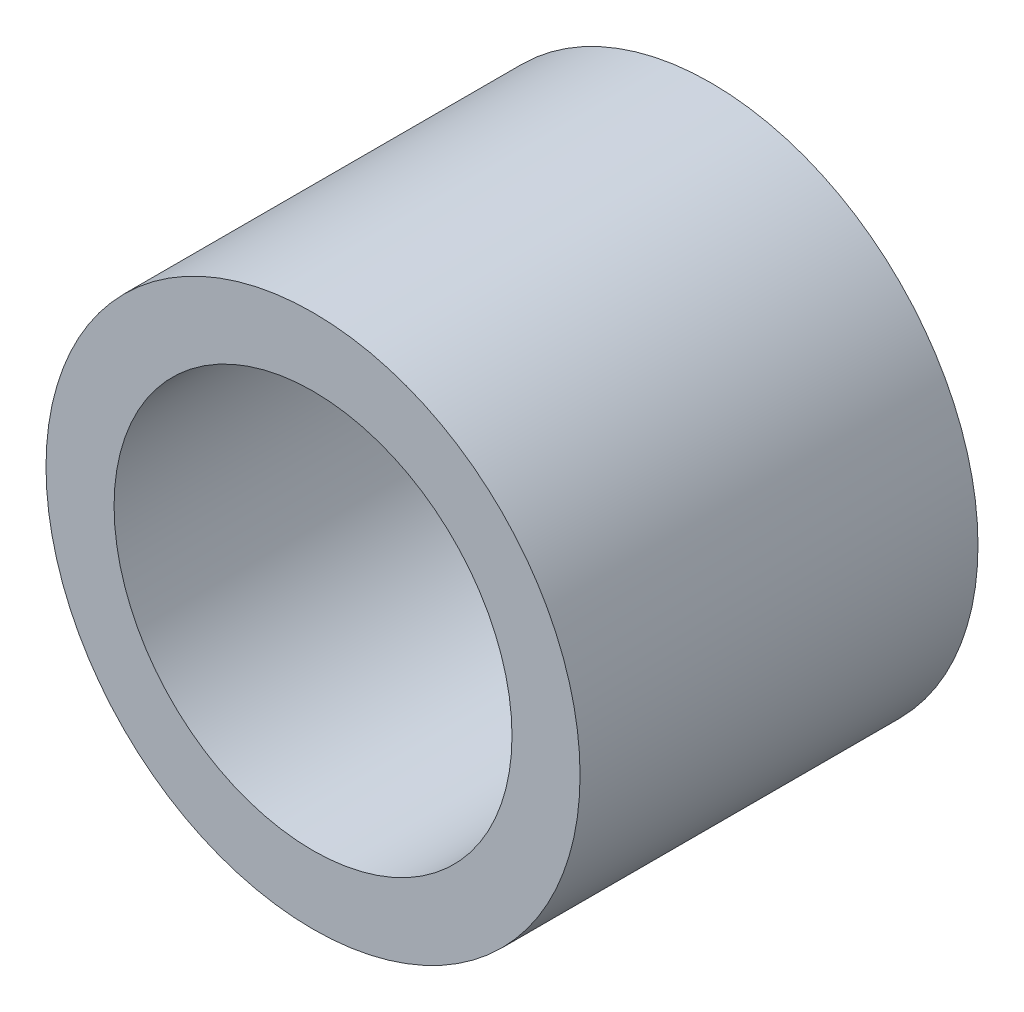
ISO-10303-21;
HEADER;
FILE_DESCRIPTION(('STEP AP214'),'2;1');
FILE_NAME('part.step','',(''),(''),'','','');
FILE_SCHEMA(('AUTOMOTIVE_DESIGN { 1 0 10303 214 1 1 1 1 }'));
ENDSEC;
DATA;
#1=APPLICATION_CONTEXT('core data for automotive mechanical design processes');
#2=APPLICATION_PROTOCOL_DEFINITION('international standard','automotive_design',2000,#1);
#3=PRODUCT_CONTEXT('',#1,'mechanical');
#4=PRODUCT('Part','Part','',(#3));
#5=PRODUCT_RELATED_PRODUCT_CATEGORY('part','',(#4));
#6=PRODUCT_DEFINITION_FORMATION('','',#4);
#7=PRODUCT_DEFINITION_CONTEXT('part definition',#1,'design');
#8=PRODUCT_DEFINITION('design','',#6,#7);
#9=PRODUCT_DEFINITION_SHAPE('','',#8);
#10=(LENGTH_UNIT() NAMED_UNIT(*) SI_UNIT(.MILLI.,.METRE.));
#11=(NAMED_UNIT(*) PLANE_ANGLE_UNIT() SI_UNIT($,.RADIAN.));
#12=(NAMED_UNIT(*) SI_UNIT($,.STERADIAN.) SOLID_ANGLE_UNIT());
#13=UNCERTAINTY_MEASURE_WITH_UNIT(LENGTH_MEASURE(1.E-05),#10,'distance_accuracy_value','');
#14=(GEOMETRIC_REPRESENTATION_CONTEXT(3) GLOBAL_UNCERTAINTY_ASSIGNED_CONTEXT((#13)) GLOBAL_UNIT_ASSIGNED_CONTEXT((#10,
#11,#12)) REPRESENTATION_CONTEXT('',''));
#15=CARTESIAN_POINT('',(0.,0.,0.));
#16=DIRECTION('',(0.,0.,1.));
#17=DIRECTION('',(1.,0.,0.));
#18=AXIS2_PLACEMENT_3D('',#15,#16,#17);
#19=CARTESIAN_POINT('',(0.,0.,19.));
#20=DIRECTION('',(0.,0.,1.));
#21=DIRECTION('',(1.,0.,0.));
#22=AXIS2_PLACEMENT_3D('',#19,#20,#21);
#23=PLANE('',#22);
#24=CARTESIAN_POINT('',(0.,0.,19.));
#25=DIRECTION('',(0.,0.,1.));
#26=DIRECTION('',(1.,0.,0.));
#27=AXIS2_PLACEMENT_3D('',#24,#25,#26);
#28=CIRCLE('',#27,12.75);
#29=CARTESIAN_POINT('',(12.75,0.,19.));
#30=VERTEX_POINT('',#29);
#31=EDGE_CURVE('E10',#30,#30,#28,.T.);
#32=ORIENTED_EDGE('',*,*,#31,.T.);
#33=EDGE_LOOP('',(#32));
#34=FACE_BOUND('',#33,.T.);
#35=CARTESIAN_POINT('',(0.,0.,19.));
#36=DIRECTION('',(0.,0.,1.));
#37=DIRECTION('',(1.,0.,0.));
#38=AXIS2_PLACEMENT_3D('',#35,#36,#37);
#39=CIRCLE('',#38,9.5);
#40=CARTESIAN_POINT('',(9.5,0.,19.));
#41=VERTEX_POINT('',#40);
#42=EDGE_CURVE('E46',#41,#41,#39,.T.);
#43=ORIENTED_EDGE('',*,*,#42,.F.);
#44=EDGE_LOOP('',(#43));
#45=FACE_BOUND('',#44,.T.);
#46=ADVANCED_FACE('F35',(#34,#45),#23,.T.);
#47=CARTESIAN_POINT('',(0.,0.,0.));
#48=DIRECTION('',(0.,0.,1.));
#49=DIRECTION('',(1.,0.,0.));
#50=AXIS2_PLACEMENT_3D('',#47,#48,#49);
#51=PLANE('',#50);
#52=CARTESIAN_POINT('',(0.,0.,0.));
#53=DIRECTION('',(0.,0.,1.));
#54=DIRECTION('',(1.,0.,0.));
#55=AXIS2_PLACEMENT_3D('',#52,#53,#54);
#56=CIRCLE('',#55,12.75);
#57=CARTESIAN_POINT('',(12.75,0.,0.));
#58=VERTEX_POINT('',#57);
#59=EDGE_CURVE('E39',#58,#58,#56,.T.);
#60=ORIENTED_EDGE('',*,*,#59,.F.);
#61=EDGE_LOOP('',(#60));
#62=FACE_BOUND('',#61,.T.);
#63=CARTESIAN_POINT('',(0.,0.,0.));
#64=DIRECTION('',(0.,0.,1.));
#65=DIRECTION('',(1.,0.,0.));
#66=AXIS2_PLACEMENT_3D('',#63,#64,#65);
#67=CIRCLE('',#66,9.5);
#68=CARTESIAN_POINT('',(9.5,0.,0.));
#69=VERTEX_POINT('',#68);
#70=EDGE_CURVE('E48',#69,#69,#67,.T.);
#71=ORIENTED_EDGE('',*,*,#70,.T.);
#72=EDGE_LOOP('',(#71));
#73=FACE_BOUND('',#72,.T.);
#74=ADVANCED_FACE('F58',(#62,#73),#51,.F.);
#75=CARTESIAN_POINT('',(0.,0.,19.));
#76=DIRECTION('',(0.,0.,-1.));
#77=DIRECTION('',(-1.,0.,0.));
#78=AXIS2_PLACEMENT_3D('',#75,#76,#77);
#79=CYLINDRICAL_SURFACE('',#78,12.75);
#80=ORIENTED_EDGE('',*,*,#31,.F.);
#81=EDGE_LOOP('',(#80));
#82=FACE_BOUND('',#81,.T.);
#83=ORIENTED_EDGE('',*,*,#59,.T.);
#84=EDGE_LOOP('',(#83));
#85=FACE_BOUND('',#84,.T.);
#86=ADVANCED_FACE('F37',(#82,#85),#79,.T.);
#87=CARTESIAN_POINT('',(0.,0.,19.));
#88=DIRECTION('',(0.,0.,-1.));
#89=DIRECTION('',(-1.,0.,0.));
#90=AXIS2_PLACEMENT_3D('',#87,#88,#89);
#91=CYLINDRICAL_SURFACE('',#90,9.5);
#92=ORIENTED_EDGE('',*,*,#42,.T.);
#93=EDGE_LOOP('',(#92));
#94=FACE_BOUND('',#93,.T.);
#95=ORIENTED_EDGE('',*,*,#70,.F.);
#96=EDGE_LOOP('',(#95));
#97=FACE_BOUND('',#96,.T.);
#98=ADVANCED_FACE('F54',(#94,#97),#91,.F.);
#99=CLOSED_SHELL('',(#46,#74,#86,#98));
#100=MANIFOLD_SOLID_BREP('B2',#99);
#101=ADVANCED_BREP_SHAPE_REPRESENTATION('',(#18,#100),#14);
#102=SHAPE_DEFINITION_REPRESENTATION(#9,#101);
ENDSEC;
END-ISO-10303-21;
